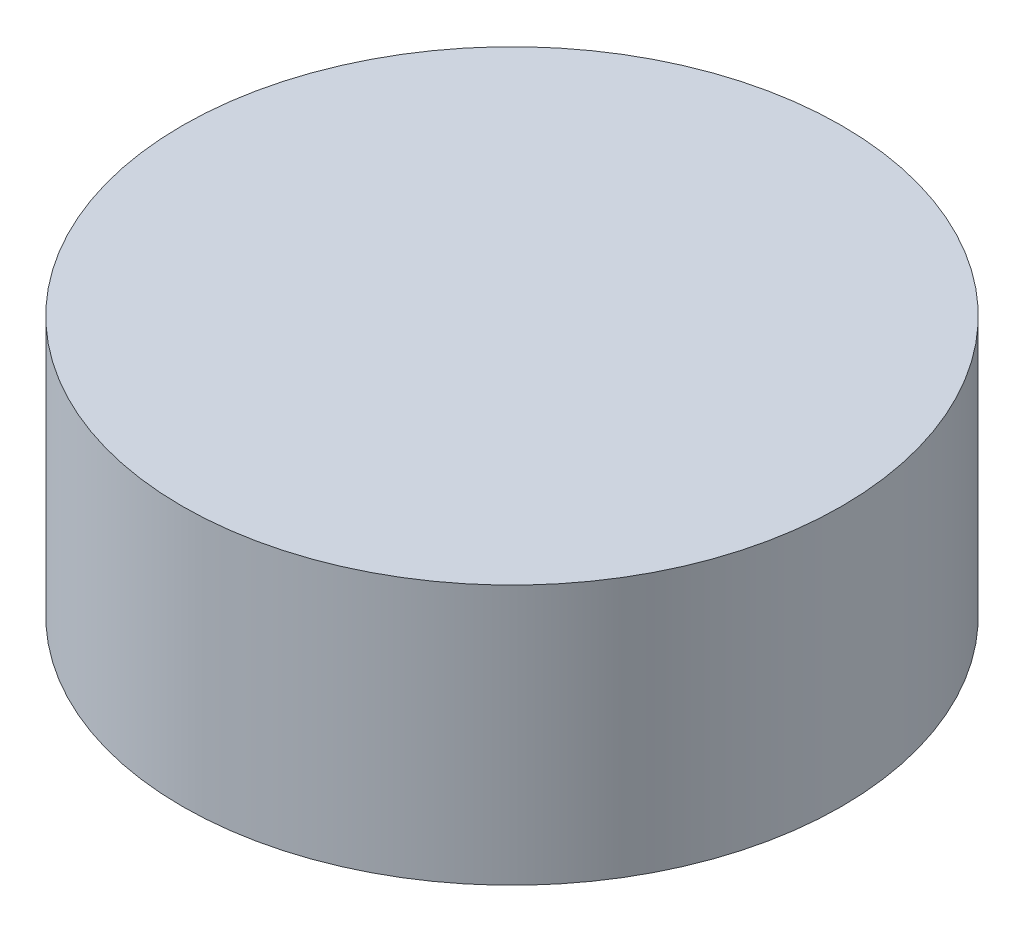
ISO-10303-21;
HEADER;
FILE_DESCRIPTION(('STEP AP214'),'2;1');
FILE_NAME('part.step','',(''),(''),'','','');
FILE_SCHEMA(('AUTOMOTIVE_DESIGN { 1 0 10303 214 1 1 1 1 }'));
ENDSEC;
DATA;
#1=APPLICATION_CONTEXT('core data for automotive mechanical design processes');
#2=APPLICATION_PROTOCOL_DEFINITION('international standard','automotive_design',2000,#1);
#3=PRODUCT_CONTEXT('',#1,'mechanical');
#4=PRODUCT('Part','Part','',(#3));
#5=PRODUCT_RELATED_PRODUCT_CATEGORY('part','',(#4));
#6=PRODUCT_DEFINITION_FORMATION('','',#4);
#7=PRODUCT_DEFINITION_CONTEXT('part definition',#1,'design');
#8=PRODUCT_DEFINITION('design','',#6,#7);
#9=PRODUCT_DEFINITION_SHAPE('','',#8);
#10=(LENGTH_UNIT() NAMED_UNIT(*) SI_UNIT(.MILLI.,.METRE.));
#11=(NAMED_UNIT(*) PLANE_ANGLE_UNIT() SI_UNIT($,.RADIAN.));
#12=(NAMED_UNIT(*) SI_UNIT($,.STERADIAN.) SOLID_ANGLE_UNIT());
#13=UNCERTAINTY_MEASURE_WITH_UNIT(LENGTH_MEASURE(1.E-05),#10,'distance_accuracy_value','');
#14=(GEOMETRIC_REPRESENTATION_CONTEXT(3) GLOBAL_UNCERTAINTY_ASSIGNED_CONTEXT((#13)) GLOBAL_UNIT_ASSIGNED_CONTEXT((#10,
#11,#12)) REPRESENTATION_CONTEXT('',''));
#15=CARTESIAN_POINT('',(0.,0.,0.));
#16=DIRECTION('',(0.,0.,1.));
#17=DIRECTION('',(1.,0.,0.));
#18=AXIS2_PLACEMENT_3D('',#15,#16,#17);
#19=CARTESIAN_POINT('',(0.,41.,0.));
#20=DIRECTION('',(0.,-1.,0.));
#21=DIRECTION('',(0.,0.,-1.));
#22=AXIS2_PLACEMENT_3D('',#19,#20,#21);
#23=CYLINDRICAL_SURFACE('',#22,52.);
#24=CARTESIAN_POINT('',(0.,41.,0.));
#25=DIRECTION('',(0.,1.,0.));
#26=DIRECTION('',(0.,0.,1.));
#27=AXIS2_PLACEMENT_3D('',#24,#25,#26);
#28=CIRCLE('',#27,52.);
#29=CARTESIAN_POINT('',(0.,41.,52.));
#30=VERTEX_POINT('',#29);
#31=EDGE_CURVE('E10',#30,#30,#28,.T.);
#32=ORIENTED_EDGE('',*,*,#31,.F.);
#33=EDGE_LOOP('',(#32));
#34=FACE_BOUND('',#33,.T.);
#35=CARTESIAN_POINT('',(0.,0.,0.));
#36=DIRECTION('',(0.,1.,0.));
#37=DIRECTION('',(0.,0.,1.));
#38=AXIS2_PLACEMENT_3D('',#35,#36,#37);
#39=CIRCLE('',#38,52.);
#40=CARTESIAN_POINT('',(0.,0.,52.));
#41=VERTEX_POINT('',#40);
#42=EDGE_CURVE('E34',#41,#41,#39,.T.);
#43=ORIENTED_EDGE('',*,*,#42,.T.);
#44=EDGE_LOOP('',(#43));
#45=FACE_BOUND('',#44,.T.);
#46=ADVANCED_FACE('F31',(#34,#45),#23,.T.);
#47=CARTESIAN_POINT('',(0.,41.,0.));
#48=DIRECTION('',(0.,1.,0.));
#49=DIRECTION('',(0.,0.,1.));
#50=AXIS2_PLACEMENT_3D('',#47,#48,#49);
#51=PLANE('',#50);
#52=ORIENTED_EDGE('',*,*,#31,.T.);
#53=EDGE_LOOP('',(#52));
#54=FACE_BOUND('',#53,.T.);
#55=ADVANCED_FACE('F46',(#54),#51,.T.);
#56=CARTESIAN_POINT('',(0.,0.,0.));
#57=DIRECTION('',(0.,1.,0.));
#58=DIRECTION('',(0.,0.,1.));
#59=AXIS2_PLACEMENT_3D('',#56,#57,#58);
#60=PLANE('',#59);
#61=ORIENTED_EDGE('',*,*,#42,.F.);
#62=EDGE_LOOP('',(#61));
#63=FACE_BOUND('',#62,.T.);
#64=ADVANCED_FACE('F44',(#63),#60,.F.);
#65=CLOSED_SHELL('',(#46,#55,#64));
#66=MANIFOLD_SOLID_BREP('B2',#65);
#67=ADVANCED_BREP_SHAPE_REPRESENTATION('',(#18,#66),#14);
#68=SHAPE_DEFINITION_REPRESENTATION(#9,#67);
ENDSEC;
END-ISO-10303-21;
